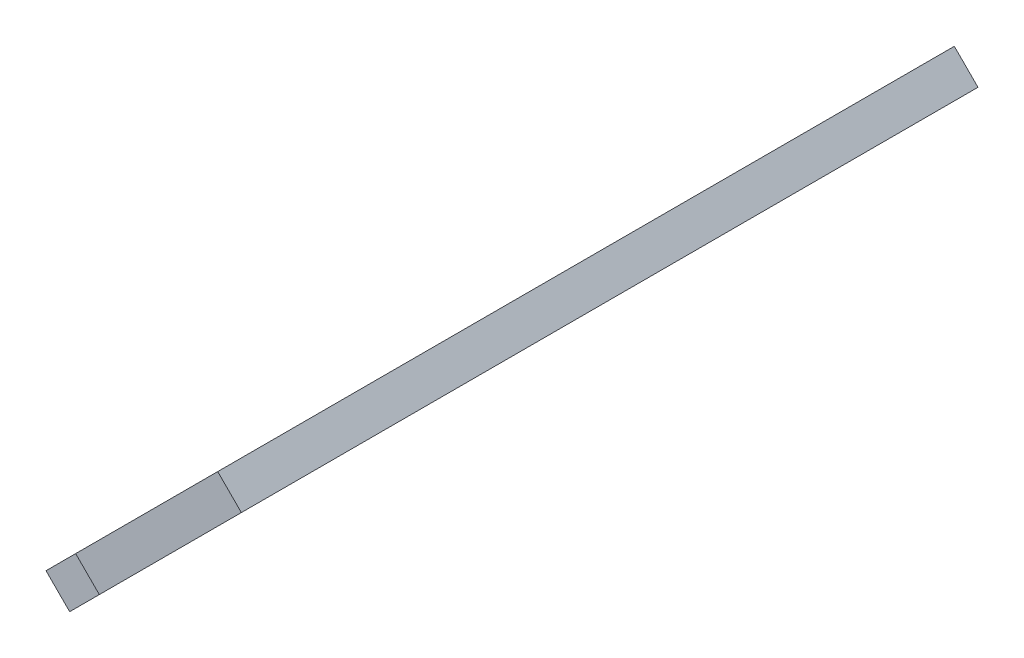
ISO-10303-21;
HEADER;
FILE_DESCRIPTION(('STEP AP214'),'2;1');
FILE_NAME('part.step','',(''),(''),'','','');
FILE_SCHEMA(('AUTOMOTIVE_DESIGN { 1 0 10303 214 1 1 1 1 }'));
ENDSEC;
DATA;
#1=APPLICATION_CONTEXT('core data for automotive mechanical design processes');
#2=APPLICATION_PROTOCOL_DEFINITION('international standard','automotive_design',2000,#1);
#3=PRODUCT_CONTEXT('',#1,'mechanical');
#4=PRODUCT('Part','Part','',(#3));
#5=PRODUCT_RELATED_PRODUCT_CATEGORY('part','',(#4));
#6=PRODUCT_DEFINITION_FORMATION('','',#4);
#7=PRODUCT_DEFINITION_CONTEXT('part definition',#1,'design');
#8=PRODUCT_DEFINITION('design','',#6,#7);
#9=PRODUCT_DEFINITION_SHAPE('','',#8);
#10=(LENGTH_UNIT() NAMED_UNIT(*) SI_UNIT(.MILLI.,.METRE.));
#11=(NAMED_UNIT(*) PLANE_ANGLE_UNIT() SI_UNIT($,.RADIAN.));
#12=(NAMED_UNIT(*) SI_UNIT($,.STERADIAN.) SOLID_ANGLE_UNIT());
#13=UNCERTAINTY_MEASURE_WITH_UNIT(LENGTH_MEASURE(1.E-05),#10,'distance_accuracy_value','');
#14=(GEOMETRIC_REPRESENTATION_CONTEXT(3) GLOBAL_UNCERTAINTY_ASSIGNED_CONTEXT((#13)) GLOBAL_UNIT_ASSIGNED_CONTEXT((#10,
#11,#12)) REPRESENTATION_CONTEXT('',''));
#15=CARTESIAN_POINT('',(0.,0.,0.));
#16=DIRECTION('',(0.,0.,1.));
#17=DIRECTION('',(1.,0.,0.));
#18=AXIS2_PLACEMENT_3D('',#15,#16,#17);
#19=CARTESIAN_POINT('',(-14.8492424049175,79.3933982822018,-66.));
#20=DIRECTION('',(0.,0.,1.));
#21=DIRECTION('',(1.,0.,0.));
#22=AXIS2_PLACEMENT_3D('',#19,#20,#21);
#23=PLANE('',#22);
#24=DIRECTION('',(-0.707106781186547,-0.707106781186547,0.));
#25=VECTOR('',#24,1.);
#26=CARTESIAN_POINT('',(-12.7279220613579,77.2720779386421,-66.));
#27=LINE('',#26,#25);
#28=CARTESIAN_POINT('',(0.,90.,-66.));
#29=VERTEX_POINT('',#28);
#30=CARTESIAN_POINT('',(-12.7279220613579,77.2720779386421,-66.));
#31=VERTEX_POINT('',#30);
#32=EDGE_CURVE('E136',#29,#31,#27,.T.);
#33=ORIENTED_EDGE('',*,*,#32,.T.);
#34=DIRECTION('',(0.707106781186548,-0.707106781186547,0.));
#35=VECTOR('',#34,1.);
#36=CARTESIAN_POINT('',(-14.8492424049175,79.3933982822018,-66.));
#37=LINE('',#36,#35);
#38=CARTESIAN_POINT('',(-14.8492424049175,79.3933982822018,-66.));
#39=VERTEX_POINT('',#38);
#40=EDGE_CURVE('E43',#39,#31,#37,.T.);
#41=ORIENTED_EDGE('',*,*,#40,.F.);
#42=DIRECTION('',(-0.707106781186547,-0.707106781186547,0.));
#43=VECTOR('',#42,1.);
#44=CARTESIAN_POINT('',(-14.8492424049175,79.3933982822018,-66.));
#45=LINE('',#44,#43);
#46=CARTESIAN_POINT('',(-2.12132034355964,92.1213203435596,-66.));
#47=VERTEX_POINT('',#46);
#48=EDGE_CURVE('E96',#47,#39,#45,.T.);
#49=ORIENTED_EDGE('',*,*,#48,.F.);
#50=DIRECTION('',(0.707106781186548,-0.707106781186547,0.));
#51=VECTOR('',#50,1.);
#52=CARTESIAN_POINT('',(-2.12132034355964,92.1213203435596,-66.));
#53=LINE('',#52,#51);
#54=EDGE_CURVE('E11',#47,#29,#53,.T.);
#55=ORIENTED_EDGE('',*,*,#54,.T.);
#56=EDGE_LOOP('',(#33,#41,#49,#55));
#57=FACE_BOUND('',#56,.T.);
#58=ADVANCED_FACE('F35',(#57),#23,.F.);
#59=CARTESIAN_POINT('',(-14.8492424049175,79.3933982822018,-63.));
#60=DIRECTION('',(0.707106781186547,0.707106781186548,0.));
#61=DIRECTION('',(-0.707106781186548,0.707106781186547,0.));
#62=AXIS2_PLACEMENT_3D('',#59,#60,#61);
#63=PLANE('',#62);
#64=DIRECTION('',(0.,0.,1.));
#65=VECTOR('',#64,1.);
#66=CARTESIAN_POINT('',(-12.7279220613579,77.2720779386421,-63.));
#67=LINE('',#66,#65);
#68=CARTESIAN_POINT('',(-12.7279220613579,77.2720779386421,-63.));
#69=VERTEX_POINT('',#68);
#70=EDGE_CURVE('E138',#31,#69,#67,.T.);
#71=ORIENTED_EDGE('',*,*,#70,.T.);
#72=DIRECTION('',(0.707106781186548,-0.707106781186547,0.));
#73=VECTOR('',#72,1.);
#74=CARTESIAN_POINT('',(-14.8492424049175,79.3933982822018,-63.));
#75=LINE('',#74,#73);
#76=CARTESIAN_POINT('',(-14.8492424049175,79.3933982822018,-63.));
#77=VERTEX_POINT('',#76);
#78=EDGE_CURVE('E155',#77,#69,#75,.T.);
#79=ORIENTED_EDGE('',*,*,#78,.F.);
#80=DIRECTION('',(0.,0.,1.));
#81=VECTOR('',#80,1.);
#82=CARTESIAN_POINT('',(-14.8492424049175,79.3933982822018,-63.));
#83=LINE('',#82,#81);
#84=EDGE_CURVE('E163',#39,#77,#83,.T.);
#85=ORIENTED_EDGE('',*,*,#84,.F.);
#86=ORIENTED_EDGE('',*,*,#40,.T.);
#87=EDGE_LOOP('',(#71,#79,#85,#86));
#88=FACE_BOUND('',#87,.T.);
#89=ADVANCED_FACE('F161',(#88),#63,.F.);
#90=CARTESIAN_POINT('',(-14.8492424049175,79.3933982822018,-63.));
#91=DIRECTION('',(0.,0.,1.));
#92=DIRECTION('',(0.,-1.,0.));
#93=AXIS2_PLACEMENT_3D('',#90,#91,#92);
#94=PLANE('',#93);
#95=DIRECTION('',(-0.707106781186547,-0.707106781186548,0.));
#96=VECTOR('',#95,1.);
#97=CARTESIAN_POINT('',(-12.7279220613579,77.2720779386421,-63.));
#98=LINE('',#97,#96);
#99=CARTESIAN_POINT('',(-18.3847763108502,71.6152236891498,-63.));
#100=VERTEX_POINT('',#99);
#101=EDGE_CURVE('E140',#69,#100,#98,.T.);
#102=ORIENTED_EDGE('',*,*,#101,.T.);
#103=DIRECTION('',(0.707106781186548,-0.707106781186547,0.));
#104=VECTOR('',#103,1.);
#105=CARTESIAN_POINT('',(-20.5060966544099,73.7365440327094,-63.));
#106=LINE('',#105,#104);
#107=CARTESIAN_POINT('',(-20.5060966544099,73.7365440327094,-63.));
#108=VERTEX_POINT('',#107);
#109=EDGE_CURVE('E152',#108,#100,#106,.T.);
#110=ORIENTED_EDGE('',*,*,#109,.F.);
#111=DIRECTION('',(-0.707106781186547,-0.707106781186548,0.));
#112=VECTOR('',#111,1.);
#113=CARTESIAN_POINT('',(-14.8492424049175,79.3933982822018,-63.));
#114=LINE('',#113,#112);
#115=EDGE_CURVE('E173',#77,#108,#114,.T.);
#116=ORIENTED_EDGE('',*,*,#115,.F.);
#117=ORIENTED_EDGE('',*,*,#78,.T.);
#118=EDGE_LOOP('',(#102,#110,#116,#117));
#119=FACE_BOUND('',#118,.T.);
#120=ADVANCED_FACE('F169',(#119),#94,.F.);
#121=CARTESIAN_POINT('',(-20.5060966544099,73.7365440327094,-63.));
#122=DIRECTION('',(0.707106781186547,0.707106781186548,0.));
#123=DIRECTION('',(-0.707106781186548,0.707106781186547,0.));
#124=AXIS2_PLACEMENT_3D('',#121,#122,#123);
#125=PLANE('',#124);
#126=DIRECTION('',(0.,0.,1.));
#127=VECTOR('',#126,1.);
#128=CARTESIAN_POINT('',(-18.3847763108502,71.6152236891498,-63.));
#129=LINE('',#128,#127);
#130=CARTESIAN_POINT('',(-18.3847763108502,71.6152236891498,-3.00000000000002));
#131=VERTEX_POINT('',#130);
#132=EDGE_CURVE('E142',#100,#131,#129,.T.);
#133=ORIENTED_EDGE('',*,*,#132,.T.);
#134=DIRECTION('',(0.707106781186548,-0.707106781186547,0.));
#135=VECTOR('',#134,1.);
#136=CARTESIAN_POINT('',(-20.5060966544099,73.7365440327094,-3.00000000000002));
#137=LINE('',#136,#135);
#138=CARTESIAN_POINT('',(-20.5060966544099,73.7365440327094,-3.00000000000002));
#139=VERTEX_POINT('',#138);
#140=EDGE_CURVE('E125',#139,#131,#137,.T.);
#141=ORIENTED_EDGE('',*,*,#140,.F.);
#142=DIRECTION('',(0.,0.,1.));
#143=VECTOR('',#142,1.);
#144=CARTESIAN_POINT('',(-20.5060966544099,73.7365440327094,-63.));
#145=LINE('',#144,#143);
#146=EDGE_CURVE('E116',#108,#139,#145,.T.);
#147=ORIENTED_EDGE('',*,*,#146,.F.);
#148=ORIENTED_EDGE('',*,*,#109,.T.);
#149=EDGE_LOOP('',(#133,#141,#147,#148));
#150=FACE_BOUND('',#149,.T.);
#151=ADVANCED_FACE('F172',(#150),#125,.F.);
#152=CARTESIAN_POINT('',(-14.8492424049175,79.3933982822018,-3.00000000000002));
#153=DIRECTION('',(0.,0.,-1.));
#154=DIRECTION('',(0.,1.,0.));
#155=AXIS2_PLACEMENT_3D('',#152,#153,#154);
#156=PLANE('',#155);
#157=DIRECTION('',(0.707106781186547,0.707106781186548,0.));
#158=VECTOR('',#157,1.);
#159=CARTESIAN_POINT('',(-12.7279220613579,77.2720779386421,-3.00000000000002));
#160=LINE('',#159,#158);
#161=CARTESIAN_POINT('',(-12.7279220613579,77.2720779386421,-3.00000000000002));
#162=VERTEX_POINT('',#161);
#163=EDGE_CURVE('E124',#131,#162,#160,.T.);
#164=ORIENTED_EDGE('',*,*,#163,.T.);
#165=DIRECTION('',(0.707106781186548,-0.707106781186547,0.));
#166=VECTOR('',#165,1.);
#167=CARTESIAN_POINT('',(-14.8492424049175,79.3933982822018,-3.00000000000002));
#168=LINE('',#167,#166);
#169=CARTESIAN_POINT('',(-14.8492424049175,79.3933982822018,-3.00000000000002));
#170=VERTEX_POINT('',#169);
#171=EDGE_CURVE('E121',#170,#162,#168,.T.);
#172=ORIENTED_EDGE('',*,*,#171,.F.);
#173=DIRECTION('',(0.707106781186547,0.707106781186548,0.));
#174=VECTOR('',#173,1.);
#175=CARTESIAN_POINT('',(-14.8492424049175,79.3933982822018,-3.00000000000002));
#176=LINE('',#175,#174);
#177=EDGE_CURVE('E110',#139,#170,#176,.T.);
#178=ORIENTED_EDGE('',*,*,#177,.F.);
#179=ORIENTED_EDGE('',*,*,#140,.T.);
#180=EDGE_LOOP('',(#164,#172,#178,#179));
#181=FACE_BOUND('',#180,.T.);
#182=ADVANCED_FACE('F122',(#181),#156,.F.);
#183=CARTESIAN_POINT('',(-14.8492424049175,79.3933982822018,-3.00000000000002));
#184=DIRECTION('',(0.707106781186547,0.707106781186548,0.));
#185=DIRECTION('',(-0.707106781186548,0.707106781186547,0.));
#186=AXIS2_PLACEMENT_3D('',#183,#184,#185);
#187=PLANE('',#186);
#188=DIRECTION('',(0.,0.,1.));
#189=VECTOR('',#188,1.);
#190=CARTESIAN_POINT('',(-12.7279220613579,77.2720779386421,-3.00000000000002));
#191=LINE('',#190,#189);
#192=CARTESIAN_POINT('',(-12.7279220613579,77.2720779386421,0.));
#193=VERTEX_POINT('',#192);
#194=EDGE_CURVE('E81',#162,#193,#191,.T.);
#195=ORIENTED_EDGE('',*,*,#194,.T.);
#196=DIRECTION('',(0.707106781186548,-0.707106781186547,0.));
#197=VECTOR('',#196,1.);
#198=CARTESIAN_POINT('',(-14.8492424049175,79.3933982822018,0.));
#199=LINE('',#198,#197);
#200=CARTESIAN_POINT('',(-14.8492424049175,79.3933982822018,0.));
#201=VERTEX_POINT('',#200);
#202=EDGE_CURVE('E126',#201,#193,#199,.T.);
#203=ORIENTED_EDGE('',*,*,#202,.F.);
#204=DIRECTION('',(0.,0.,1.));
#205=VECTOR('',#204,1.);
#206=CARTESIAN_POINT('',(-14.8492424049175,79.3933982822018,-3.00000000000002));
#207=LINE('',#206,#205);
#208=EDGE_CURVE('E114',#170,#201,#207,.T.);
#209=ORIENTED_EDGE('',*,*,#208,.F.);
#210=ORIENTED_EDGE('',*,*,#171,.T.);
#211=EDGE_LOOP('',(#195,#203,#209,#210));
#212=FACE_BOUND('',#211,.T.);
#213=ADVANCED_FACE('F128',(#212),#187,.F.);
#214=CARTESIAN_POINT('',(-14.8492424049175,79.3933982822018,0.));
#215=DIRECTION('',(0.,0.,-1.));
#216=DIRECTION('',(-1.,0.,0.));
#217=AXIS2_PLACEMENT_3D('',#214,#215,#216);
#218=PLANE('',#217);
#219=DIRECTION('',(0.707106781186547,0.707106781186547,0.));
#220=VECTOR('',#219,1.);
#221=CARTESIAN_POINT('',(-12.7279220613579,77.2720779386421,0.));
#222=LINE('',#221,#220);
#223=CARTESIAN_POINT('',(0.,90.,0.));
#224=VERTEX_POINT('',#223);
#225=EDGE_CURVE('E146',#193,#224,#222,.T.);
#226=ORIENTED_EDGE('',*,*,#225,.T.);
#227=DIRECTION('',(0.707106781186548,-0.707106781186547,0.));
#228=VECTOR('',#227,1.);
#229=CARTESIAN_POINT('',(-2.12132034355964,92.1213203435596,0.));
#230=LINE('',#229,#228);
#231=CARTESIAN_POINT('',(-2.12132034355964,92.1213203435596,0.));
#232=VERTEX_POINT('',#231);
#233=EDGE_CURVE('E132',#232,#224,#230,.T.);
#234=ORIENTED_EDGE('',*,*,#233,.F.);
#235=DIRECTION('',(0.707106781186547,0.707106781186547,0.));
#236=VECTOR('',#235,1.);
#237=CARTESIAN_POINT('',(-14.8492424049175,79.3933982822018,0.));
#238=LINE('',#237,#236);
#239=EDGE_CURVE('E130',#201,#232,#238,.T.);
#240=ORIENTED_EDGE('',*,*,#239,.F.);
#241=ORIENTED_EDGE('',*,*,#202,.T.);
#242=EDGE_LOOP('',(#226,#234,#240,#241));
#243=FACE_BOUND('',#242,.T.);
#244=ADVANCED_FACE('F195',(#243),#218,.F.);
#245=CARTESIAN_POINT('',(-2.12132034355964,92.1213203435596,-63.));
#246=DIRECTION('',(-0.707106781186547,-0.707106781186548,0.));
#247=DIRECTION('',(0.707106781186548,-0.707106781186547,0.));
#248=AXIS2_PLACEMENT_3D('',#245,#246,#247);
#249=PLANE('',#248);
#250=DIRECTION('',(0.,0.,-1.));
#251=VECTOR('',#250,1.);
#252=CARTESIAN_POINT('',(0.,90.,-63.));
#253=LINE('',#252,#251);
#254=EDGE_CURVE('E88',#224,#29,#253,.T.);
#255=ORIENTED_EDGE('',*,*,#254,.T.);
#256=ORIENTED_EDGE('',*,*,#54,.F.);
#257=DIRECTION('',(0.,0.,-1.));
#258=VECTOR('',#257,1.);
#259=CARTESIAN_POINT('',(-2.12132034355964,92.1213203435596,-66.));
#260=LINE('',#259,#258);
#261=EDGE_CURVE('E51',#232,#47,#260,.T.);
#262=ORIENTED_EDGE('',*,*,#261,.F.);
#263=ORIENTED_EDGE('',*,*,#233,.T.);
#264=EDGE_LOOP('',(#255,#256,#262,#263));
#265=FACE_BOUND('',#264,.T.);
#266=ADVANCED_FACE('F179',(#265),#249,.F.);
#267=CARTESIAN_POINT('',(-47.1213203435596,47.1213203435596,0.));
#268=DIRECTION('',(-0.707106781186548,0.707106781186548,0.));
#269=DIRECTION('',(-0.707106781186548,-0.707106781186548,0.));
#270=AXIS2_PLACEMENT_3D('',#267,#268,#269);
#271=PLANE('',#270);
#272=ORIENTED_EDGE('',*,*,#261,.T.);
#273=ORIENTED_EDGE('',*,*,#48,.T.);
#274=ORIENTED_EDGE('',*,*,#84,.T.);
#275=ORIENTED_EDGE('',*,*,#115,.T.);
#276=ORIENTED_EDGE('',*,*,#146,.T.);
#277=ORIENTED_EDGE('',*,*,#177,.T.);
#278=ORIENTED_EDGE('',*,*,#208,.T.);
#279=ORIENTED_EDGE('',*,*,#239,.T.);
#280=EDGE_LOOP('',(#272,#273,#274,#275,#276,#277,#278,#279));
#281=FACE_BOUND('',#280,.T.);
#282=ADVANCED_FACE('F112',(#281),#271,.T.);
#283=CARTESIAN_POINT('',(-45.,45.,0.));
#284=DIRECTION('',(-0.707106781186548,0.707106781186548,0.));
#285=DIRECTION('',(-0.707106781186548,-0.707106781186548,0.));
#286=AXIS2_PLACEMENT_3D('',#283,#284,#285);
#287=PLANE('',#286);
#288=ORIENTED_EDGE('',*,*,#32,.F.);
#289=ORIENTED_EDGE('',*,*,#254,.F.);
#290=ORIENTED_EDGE('',*,*,#225,.F.);
#291=ORIENTED_EDGE('',*,*,#194,.F.);
#292=ORIENTED_EDGE('',*,*,#163,.F.);
#293=ORIENTED_EDGE('',*,*,#132,.F.);
#294=ORIENTED_EDGE('',*,*,#101,.F.);
#295=ORIENTED_EDGE('',*,*,#70,.F.);
#296=EDGE_LOOP('',(#288,#289,#290,#291,#292,#293,#294,#295));
#297=FACE_BOUND('',#296,.T.);
#298=ADVANCED_FACE('F165',(#297),#287,.F.);
#299=CLOSED_SHELL('',(#58,#89,#120,#151,#182,#213,#244,#266,#282,#298));
#300=MANIFOLD_SOLID_BREP('B2',#299);
#301=ADVANCED_BREP_SHAPE_REPRESENTATION('',(#18,#300),#14);
#302=SHAPE_DEFINITION_REPRESENTATION(#9,#301);
ENDSEC;
END-ISO-10303-21;
